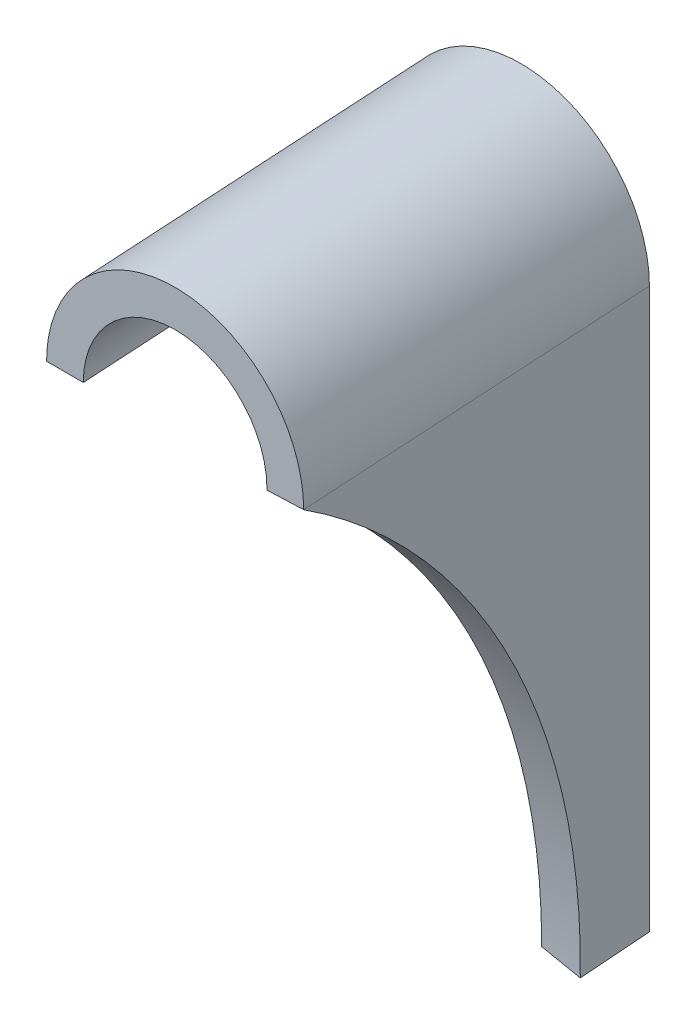
ISO-10303-21;
HEADER;
FILE_DESCRIPTION(('STEP AP214'),'2;1');
FILE_NAME('part.step','',(''),(''),'','','');
FILE_SCHEMA(('AUTOMOTIVE_DESIGN { 1 0 10303 214 1 1 1 1 }'));
ENDSEC;
DATA;
#1=APPLICATION_CONTEXT('core data for automotive mechanical design processes');
#2=APPLICATION_PROTOCOL_DEFINITION('international standard','automotive_design',2000,#1);
#3=PRODUCT_CONTEXT('',#1,'mechanical');
#4=PRODUCT('Part','Part','',(#3));
#5=PRODUCT_RELATED_PRODUCT_CATEGORY('part','',(#4));
#6=PRODUCT_DEFINITION_FORMATION('','',#4);
#7=PRODUCT_DEFINITION_CONTEXT('part definition',#1,'design');
#8=PRODUCT_DEFINITION('design','',#6,#7);
#9=PRODUCT_DEFINITION_SHAPE('','',#8);
#10=(LENGTH_UNIT() NAMED_UNIT(*) SI_UNIT(.MILLI.,.METRE.));
#11=(NAMED_UNIT(*) PLANE_ANGLE_UNIT() SI_UNIT($,.RADIAN.));
#12=(NAMED_UNIT(*) SI_UNIT($,.STERADIAN.) SOLID_ANGLE_UNIT());
#13=UNCERTAINTY_MEASURE_WITH_UNIT(LENGTH_MEASURE(1.E-05),#10,'distance_accuracy_value','');
#14=(GEOMETRIC_REPRESENTATION_CONTEXT(3) GLOBAL_UNCERTAINTY_ASSIGNED_CONTEXT((#13)) GLOBAL_UNIT_ASSIGNED_CONTEXT((#10,
#11,#12)) REPRESENTATION_CONTEXT('',''));
#15=CARTESIAN_POINT('',(0.,0.,0.));
#16=DIRECTION('',(0.,0.,1.));
#17=DIRECTION('',(1.,0.,0.));
#18=AXIS2_PLACEMENT_3D('',#15,#16,#17);
#19=CARTESIAN_POINT('',(0.,0.,-10.));
#20=DIRECTION('',(0.,0.,-1.));
#21=DIRECTION('',(1.,0.,0.));
#22=AXIS2_PLACEMENT_3D('',#19,#20,#21);
#23=PLANE('',#22);
#24=DIRECTION('',(0.,-1.,0.));
#25=VECTOR('',#24,1.);
#26=CARTESIAN_POINT('',(-114.770321228191,0.,-10.));
#27=LINE('',#26,#25);
#28=CARTESIAN_POINT('',(-114.770321228191,64.2083159442407,-10.));
#29=VERTEX_POINT('',#28);
#30=CARTESIAN_POINT('',(-114.770321228191,-12.0791229983124,-10.));
#31=VERTEX_POINT('',#30);
#32=EDGE_CURVE('E107',#29,#31,#27,.T.);
#33=ORIENTED_EDGE('',*,*,#32,.T.);
#34=DIRECTION('',(-0.965925826289068,0.258819045102521,0.));
#35=VECTOR('',#34,1.);
#36=CARTESIAN_POINT('',(-10.7079344716167,-39.9625554921918,-10.));
#37=LINE('',#36,#35);
#38=CARTESIAN_POINT('',(-119.778475403574,-10.737192131448,-9.99999999999976));
#39=VERTEX_POINT('',#38);
#40=EDGE_CURVE('E45',#31,#39,#37,.T.);
#41=ORIENTED_EDGE('',*,*,#40,.T.);
#42=DIRECTION('',(0.,1.,0.));
#43=VECTOR('',#42,1.);
#44=CARTESIAN_POINT('',(-119.778475403574,0.,-10.));
#45=LINE('',#44,#43);
#46=CARTESIAN_POINT('',(-119.778475403574,64.2083159442407,-9.99999999999976));
#47=VERTEX_POINT('',#46);
#48=EDGE_CURVE('E142',#39,#47,#45,.T.);
#49=ORIENTED_EDGE('',*,*,#48,.T.);
#50=CARTESIAN_POINT('',(-132.298860842031,64.2083159442407,-10.));
#51=DIRECTION('',(0.,0.,1.));
#52=DIRECTION('',(-1.,0.,0.));
#53=AXIS2_PLACEMENT_3D('',#50,#51,#52);
#54=ELLIPSE('',#53,12.5203854384569,12.5);
#55=CARTESIAN_POINT('',(-144.819246280488,64.2083159442407,-9.99999999999999));
#56=VERTEX_POINT('',#55);
#57=EDGE_CURVE('E102',#47,#56,#54,.T.);
#58=ORIENTED_EDGE('',*,*,#57,.T.);
#59=DIRECTION('',(1.,0.,0.));
#60=VECTOR('',#59,1.);
#61=CARTESIAN_POINT('',(-165.74301662356,64.2083159442407,-10.));
#62=LINE('',#61,#60);
#63=CARTESIAN_POINT('',(-149.827400455871,64.2083159442407,-9.99999999999999));
#64=VERTEX_POINT('',#63);
#65=EDGE_CURVE('E109',#64,#56,#62,.T.);
#66=ORIENTED_EDGE('',*,*,#65,.F.);
#67=CARTESIAN_POINT('',(-132.298860842031,64.2083159442407,-10.));
#68=DIRECTION('',(0.,0.,1.));
#69=DIRECTION('',(-1.,0.,0.));
#70=AXIS2_PLACEMENT_3D('',#67,#68,#69);
#71=ELLIPSE('',#70,17.5285396138397,17.5);
#72=EDGE_CURVE('E97',#29,#64,#71,.T.);
#73=ORIENTED_EDGE('',*,*,#72,.F.);
#74=EDGE_LOOP('',(#33,#41,#49,#58,#66,#73));
#75=FACE_BOUND('',#74,.T.);
#76=ADVANCED_FACE('F37',(#75),#23,.T.);
#77=CARTESIAN_POINT('',(-165.74301662356,64.2083159442407,40.));
#78=DIRECTION('',(0.,-1.,0.));
#79=DIRECTION('',(0.,0.,1.));
#80=AXIS2_PLACEMENT_3D('',#77,#78,#79);
#81=PLANE('',#80);
#82=DIRECTION('',(-0.0570412885398924,0.,-0.99837182021615));
#83=VECTOR('',#82,1.);
#84=CARTESIAN_POINT('',(-141.500625900315,64.2083159442407,48.0845411169636));
#85=LINE('',#84,#83);
#86=CARTESIAN_POINT('',(-141.962530606785,64.2083159442407,40.));
#87=VERTEX_POINT('',#86);
#88=EDGE_CURVE('E132',#87,#56,#85,.T.);
#89=ORIENTED_EDGE('',*,*,#88,.F.);
#90=DIRECTION('',(1.,0.,0.));
#91=VECTOR('',#90,1.);
#92=CARTESIAN_POINT('',(-165.74301662356,64.2083159442407,40.));
#93=LINE('',#92,#91);
#94=CARTESIAN_POINT('',(-146.970684782168,64.2083159442407,40.));
#95=VERTEX_POINT('',#94);
#96=EDGE_CURVE('E139',#95,#87,#93,.T.);
#97=ORIENTED_EDGE('',*,*,#96,.F.);
#98=DIRECTION('',(-0.0570412885398924,0.,-0.99837182021615));
#99=VECTOR('',#98,1.);
#100=CARTESIAN_POINT('',(-146.492485001395,64.2083159442407,48.369747559663));
#101=LINE('',#100,#99);
#102=EDGE_CURVE('E60',#95,#64,#101,.T.);
#103=ORIENTED_EDGE('',*,*,#102,.T.);
#104=ORIENTED_EDGE('',*,*,#65,.T.);
#105=EDGE_LOOP('',(#89,#97,#103,#104));
#106=FACE_BOUND('',#105,.T.);
#107=ADVANCED_FACE('F156',(#106),#81,.T.);
#108=CARTESIAN_POINT('',(0.,0.,40.));
#109=DIRECTION('',(0.,0.,-1.));
#110=DIRECTION('',(1.,0.,0.));
#111=AXIS2_PLACEMENT_3D('',#108,#109,#110);
#112=PLANE('',#111);
#113=CARTESIAN_POINT('',(-129.442145168328,64.2083159442407,40.));
#114=DIRECTION('',(0.,0.,1.));
#115=DIRECTION('',(-1.,0.,0.));
#116=AXIS2_PLACEMENT_3D('',#113,#114,#115);
#117=ELLIPSE('',#116,17.5285396138397,17.5);
#118=CARTESIAN_POINT('',(-111.913605554488,64.2083159442407,40.));
#119=VERTEX_POINT('',#118);
#120=EDGE_CURVE('E11',#119,#95,#117,.T.);
#121=ORIENTED_EDGE('',*,*,#120,.T.);
#122=ORIENTED_EDGE('',*,*,#96,.T.);
#123=CARTESIAN_POINT('',(-129.442145168328,64.2083159442407,40.));
#124=DIRECTION('',(0.,0.,1.));
#125=DIRECTION('',(-1.,0.,0.));
#126=AXIS2_PLACEMENT_3D('',#123,#124,#125);
#127=ELLIPSE('',#126,12.5203854384569,12.5);
#128=CARTESIAN_POINT('',(-116.921759729871,64.2083159442407,40.));
#129=VERTEX_POINT('',#128);
#130=EDGE_CURVE('E134',#129,#87,#127,.T.);
#131=ORIENTED_EDGE('',*,*,#130,.F.);
#132=DIRECTION('',(0.,1.,0.));
#133=VECTOR('',#132,1.);
#134=CARTESIAN_POINT('',(-116.921759729871,-53.2440936926434,40.));
#135=LINE('',#134,#133);
#136=CARTESIAN_POINT('',(-116.921759729871,64.017088464631,40.));
#137=VERTEX_POINT('',#136);
#138=EDGE_CURVE('E126',#137,#129,#135,.T.);
#139=ORIENTED_EDGE('',*,*,#138,.F.);
#140=CARTESIAN_POINT('',(763.265329820694,-10.6773328411647,40.));
#141=DIRECTION('',(0.,0.,1.));
#142=DIRECTION('',(1.,0.,0.));
#143=AXIS2_PLACEMENT_3D('',#140,#141,#142);
#144=ELLIPSE('',#143,1577.80446942494,90.);
#145=EDGE_CURVE('E124',#119,#137,#144,.T.);
#146=ORIENTED_EDGE('',*,*,#145,.F.);
#147=EDGE_LOOP('',(#121,#122,#131,#139,#146));
#148=FACE_BOUND('',#147,.T.);
#149=ADVANCED_FACE('F158',(#148),#112,.F.);
#150=CARTESIAN_POINT('',(-10.7079344716167,-39.9625554921918,-10.));
#151=DIRECTION('',(-0.258819045102521,-0.965925826289068,0.));
#152=DIRECTION('',(0.965925826289068,-0.258819045102521,0.));
#153=AXIS2_PLACEMENT_3D('',#150,#151,#152);
#154=PLANE('',#153);
#155=DIRECTION('',(0.0570346271199998,-0.0152823822774142,0.998255227935827));
#156=VECTOR('',#155,1.);
#157=CARTESIAN_POINT('',(-114.407507727297,-12.1763385828802,-3.64981429138124));
#158=LINE('',#157,#156);
#159=CARTESIAN_POINT('',(-114.198978093451,-12.2322139298705,0.));
#160=VERTEX_POINT('',#159);
#161=EDGE_CURVE('E113',#31,#160,#158,.T.);
#162=ORIENTED_EDGE('',*,*,#161,.T.);
#163=CARTESIAN_POINT('',(-120.001873316217,-10.6773328411647,90.4648652653761));
#164=DIRECTION('',(0.258819045102521,0.965925826289068,0.));
#165=DIRECTION('',(0.964240505891296,-0.25836746486295,-0.0590465909159068));
#166=AXIS2_PLACEMENT_3D('',#163,#164,#165);
#167=ELLIPSE('',#166,348.300393122854,90.);
#168=CARTESIAN_POINT('',(-119.191588458902,-10.8944480143213,0.272057350239968));
#169=VERTEX_POINT('',#168);
#170=EDGE_CURVE('E121',#160,#169,#167,.T.);
#171=ORIENTED_EDGE('',*,*,#170,.T.);
#172=DIRECTION('',(-0.0570346271200015,0.0152823822774146,-0.998255227935827));
#173=VECTOR('',#172,1.);
#174=CARTESIAN_POINT('',(-119.398200973654,-10.8390863578474,-3.34420234010542));
#175=LINE('',#174,#173);
#176=EDGE_CURVE('E129',#169,#39,#175,.T.);
#177=ORIENTED_EDGE('',*,*,#176,.T.);
#178=ORIENTED_EDGE('',*,*,#40,.F.);
#179=EDGE_LOOP('',(#162,#171,#177,#178));
#180=FACE_BOUND('',#179,.T.);
#181=ADVANCED_FACE('F39',(#180),#154,.T.);
#182=CARTESIAN_POINT('',(-129.020978147613,64.2083159442407,47.3715250102149));
#183=DIRECTION('',(-0.0570412885398924,0.,-0.99837182021615));
#184=DIRECTION('',(0.99837182021615,0.,-0.0570412885398924));
#185=AXIS2_PLACEMENT_3D('',#182,#183,#184);
#186=CYLINDRICAL_SURFACE('',#185,17.5);
#187=DIRECTION('',(-0.0570412885398924,0.,-0.99837182021615));
#188=VECTOR('',#187,1.);
#189=CARTESIAN_POINT('',(-111.54947129383,64.2083159442407,46.3733024607668));
#190=LINE('',#189,#188);
#191=EDGE_CURVE('E94',#119,#29,#190,.T.);
#192=ORIENTED_EDGE('',*,*,#191,.T.);
#193=ORIENTED_EDGE('',*,*,#72,.T.);
#194=ORIENTED_EDGE('',*,*,#102,.F.);
#195=ORIENTED_EDGE('',*,*,#120,.F.);
#196=EDGE_LOOP('',(#192,#193,#194,#195));
#197=FACE_BOUND('',#196,.T.);
#198=ADVANCED_FACE('F96',(#197),#186,.T.);
#199=CARTESIAN_POINT('',(-129.020978147613,64.2083159442407,47.3715250102149));
#200=DIRECTION('',(-0.0570412885398924,0.,-0.99837182021615));
#201=DIRECTION('',(0.99837182021615,0.,-0.0570412885398924));
#202=AXIS2_PLACEMENT_3D('',#199,#200,#201);
#203=CYLINDRICAL_SURFACE('',#202,12.5);
#204=ORIENTED_EDGE('',*,*,#57,.F.);
#205=DIRECTION('',(-0.0570412885398924,0.,-0.99837182021615));
#206=VECTOR('',#205,1.);
#207=CARTESIAN_POINT('',(-116.541330394911,64.2083159442407,46.6585089034663));
#208=LINE('',#207,#206);
#209=EDGE_CURVE('E131',#129,#47,#208,.T.);
#210=ORIENTED_EDGE('',*,*,#209,.F.);
#211=ORIENTED_EDGE('',*,*,#130,.T.);
#212=ORIENTED_EDGE('',*,*,#88,.T.);
#213=EDGE_LOOP('',(#204,#210,#211,#212));
#214=FACE_BOUND('',#213,.T.);
#215=ADVANCED_FACE('F154',(#214),#203,.F.);
#216=CARTESIAN_POINT('',(-119.207132268833,-38.8125,0.));
#217=DIRECTION('',(0.99837182021615,0.,-0.0570412885398942));
#218=DIRECTION('',(0.0570412885398942,0.,0.99837182021615));
#219=AXIS2_PLACEMENT_3D('',#216,#217,#218);
#220=PLANE('',#219);
#221=ORIENTED_EDGE('',*,*,#138,.T.);
#222=ORIENTED_EDGE('',*,*,#209,.T.);
#223=ORIENTED_EDGE('',*,*,#48,.F.);
#224=ORIENTED_EDGE('',*,*,#176,.F.);
#225=CARTESIAN_POINT('',(-114.057887428495,-10.6773328411647,90.1252597123817));
#226=DIRECTION('',(-0.99837182021615,0.,0.0570412885398942));
#227=DIRECTION('',(0.0570412885398942,0.,0.99837182021615));
#228=AXIS2_PLACEMENT_3D('',#225,#226,#227);
#229=CIRCLE('',#228,90.);
#230=EDGE_CURVE('E116',#137,#169,#229,.T.);
#231=ORIENTED_EDGE('',*,*,#230,.F.);
#232=EDGE_LOOP('',(#221,#222,#223,#224,#231));
#233=FACE_BOUND('',#232,.T.);
#234=ADVANCED_FACE('F149',(#233),#220,.F.);
#235=CARTESIAN_POINT('',(-111.913605554488,-53.2440936926434,40.));
#236=DIRECTION('',(-0.99837182021615,0.,0.0570412885398925));
#237=DIRECTION('',(-0.0570412885398925,0.,-0.99837182021615));
#238=AXIS2_PLACEMENT_3D('',#235,#236,#237);
#239=PLANE('',#238);
#240=CARTESIAN_POINT('',(-109.066028327415,-10.6773328411647,89.8400532696823));
#241=DIRECTION('',(-0.99837182021615,0.,0.0570412885398925));
#242=DIRECTION('',(0.0570412885398925,0.,0.99837182021615));
#243=AXIS2_PLACEMENT_3D('',#240,#241,#242);
#244=CIRCLE('',#243,90.);
#245=EDGE_CURVE('E52',#119,#160,#244,.T.);
#246=ORIENTED_EDGE('',*,*,#245,.T.);
#247=ORIENTED_EDGE('',*,*,#161,.F.);
#248=ORIENTED_EDGE('',*,*,#32,.F.);
#249=ORIENTED_EDGE('',*,*,#191,.F.);
#250=EDGE_LOOP('',(#246,#247,#248,#249));
#251=FACE_BOUND('',#250,.T.);
#252=ADVANCED_FACE('F111',(#251),#239,.F.);
#253=CARTESIAN_POINT('',(-158.984619338222,-10.6773328411647,92.6921176966769));
#254=DIRECTION('',(0.99837182021615,0.,-0.0570412885398925));
#255=DIRECTION('',(0.0570412885398925,0.,0.99837182021615));
#256=AXIS2_PLACEMENT_3D('',#253,#254,#255);
#257=CYLINDRICAL_SURFACE('',#256,90.);
#258=ORIENTED_EDGE('',*,*,#145,.T.);
#259=ORIENTED_EDGE('',*,*,#230,.T.);
#260=ORIENTED_EDGE('',*,*,#170,.F.);
#261=ORIENTED_EDGE('',*,*,#245,.F.);
#262=EDGE_LOOP('',(#258,#259,#260,#261));
#263=FACE_BOUND('',#262,.T.);
#264=ADVANCED_FACE('F175',(#263),#257,.F.);
#265=CLOSED_SHELL('',(#76,#107,#149,#181,#198,#215,#234,#252,#264));
#266=MANIFOLD_SOLID_BREP('B2',#265);
#267=ADVANCED_BREP_SHAPE_REPRESENTATION('',(#18,#266),#14);
#268=SHAPE_DEFINITION_REPRESENTATION(#9,#267);
ENDSEC;
END-ISO-10303-21;
